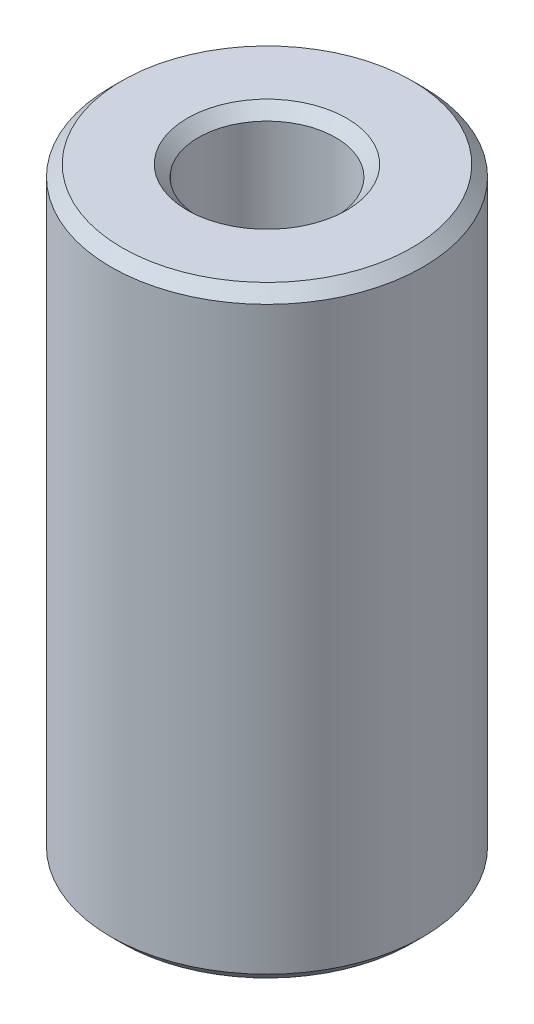
ISO-10303-21;
HEADER;
FILE_DESCRIPTION(('STEP AP214'),'2;1');
FILE_NAME('part.step','',(''),(''),'','','');
FILE_SCHEMA(('AUTOMOTIVE_DESIGN { 1 0 10303 214 1 1 1 1 }'));
ENDSEC;
DATA;
#1=APPLICATION_CONTEXT('core data for automotive mechanical design processes');
#2=APPLICATION_PROTOCOL_DEFINITION('international standard','automotive_design',2000,#1);
#3=PRODUCT_CONTEXT('',#1,'mechanical');
#4=PRODUCT('Part','Part','',(#3));
#5=PRODUCT_RELATED_PRODUCT_CATEGORY('part','',(#4));
#6=PRODUCT_DEFINITION_FORMATION('','',#4);
#7=PRODUCT_DEFINITION_CONTEXT('part definition',#1,'design');
#8=PRODUCT_DEFINITION('design','',#6,#7);
#9=PRODUCT_DEFINITION_SHAPE('','',#8);
#10=(LENGTH_UNIT() NAMED_UNIT(*) SI_UNIT(.MILLI.,.METRE.));
#11=(NAMED_UNIT(*) PLANE_ANGLE_UNIT() SI_UNIT($,.RADIAN.));
#12=(NAMED_UNIT(*) SI_UNIT($,.STERADIAN.) SOLID_ANGLE_UNIT());
#13=UNCERTAINTY_MEASURE_WITH_UNIT(LENGTH_MEASURE(1.E-05),#10,'distance_accuracy_value','');
#14=(GEOMETRIC_REPRESENTATION_CONTEXT(3) GLOBAL_UNCERTAINTY_ASSIGNED_CONTEXT((#13)) GLOBAL_UNIT_ASSIGNED_CONTEXT((#10,
#11,#12)) REPRESENTATION_CONTEXT('',''));
#15=CARTESIAN_POINT('',(0.,0.,0.));
#16=DIRECTION('',(0.,0.,1.));
#17=DIRECTION('',(1.,0.,0.));
#18=AXIS2_PLACEMENT_3D('',#15,#16,#17);
#19=CARTESIAN_POINT('',(0.,28.9714536347229,0.));
#20=DIRECTION('',(0.,-1.,0.));
#21=DIRECTION('',(0.,0.,-1.));
#22=AXIS2_PLACEMENT_3D('',#19,#20,#21);
#23=CYLINDRICAL_SURFACE('',#22,7.5);
#24=CARTESIAN_POINT('',(0.,0.535824261476907,0.));
#25=DIRECTION('',(0.,1.,0.));
#26=DIRECTION('',(0.,0.,1.));
#27=AXIS2_PLACEMENT_3D('',#24,#25,#26);
#28=CIRCLE('',#27,7.5);
#29=CARTESIAN_POINT('',(0.,0.535824261476907,7.5));
#30=VERTEX_POINT('',#29);
#31=EDGE_CURVE('E10',#30,#30,#28,.T.);
#32=ORIENTED_EDGE('',*,*,#31,.T.);
#33=EDGE_LOOP('',(#32));
#34=FACE_BOUND('',#33,.T.);
#35=CARTESIAN_POINT('',(0.,28.435629373246,0.));
#36=DIRECTION('',(0.,1.,0.));
#37=DIRECTION('',(0.,0.,1.));
#38=AXIS2_PLACEMENT_3D('',#35,#36,#37);
#39=CIRCLE('',#38,7.5);
#40=CARTESIAN_POINT('',(0.,28.435629373246,7.5));
#41=VERTEX_POINT('',#40);
#42=EDGE_CURVE('E50',#41,#41,#39,.F.);
#43=ORIENTED_EDGE('',*,*,#42,.T.);
#44=EDGE_LOOP('',(#43));
#45=FACE_BOUND('',#44,.T.);
#46=ADVANCED_FACE('F39',(#34,#45),#23,.T.);
#47=CARTESIAN_POINT('',(0.,28.9714536347229,0.));
#48=DIRECTION('',(0.,1.,0.));
#49=DIRECTION('',(0.,0.,1.));
#50=AXIS2_PLACEMENT_3D('',#47,#48,#49);
#51=PLANE('',#50);
#52=CARTESIAN_POINT('',(0.,28.9714536347229,0.));
#53=DIRECTION('',(0.,1.,0.));
#54=DIRECTION('',(0.,0.,1.));
#55=AXIS2_PLACEMENT_3D('',#52,#53,#54);
#56=CIRCLE('',#55,3.83472451411904);
#57=CARTESIAN_POINT('',(0.,28.9714536347229,3.83472451411904));
#58=VERTEX_POINT('',#57);
#59=EDGE_CURVE('E58',#58,#58,#56,.F.);
#60=ORIENTED_EDGE('',*,*,#59,.T.);
#61=EDGE_LOOP('',(#60));
#62=FACE_BOUND('',#61,.T.);
#63=CARTESIAN_POINT('',(0.,28.9714536347229,0.));
#64=DIRECTION('',(0.,1.,0.));
#65=DIRECTION('',(0.,0.,1.));
#66=AXIS2_PLACEMENT_3D('',#63,#64,#65);
#67=CIRCLE('',#66,6.9641757385231);
#68=CARTESIAN_POINT('',(0.,28.9714536347229,6.9641757385231));
#69=VERTEX_POINT('',#68);
#70=EDGE_CURVE('E61',#69,#69,#67,.T.);
#71=ORIENTED_EDGE('',*,*,#70,.T.);
#72=EDGE_LOOP('',(#71));
#73=FACE_BOUND('',#72,.T.);
#74=ADVANCED_FACE('F88',(#62,#73),#51,.T.);
#75=CARTESIAN_POINT('',(0.,0.,0.));
#76=DIRECTION('',(0.,1.,0.));
#77=DIRECTION('',(0.,0.,1.));
#78=AXIS2_PLACEMENT_3D('',#75,#76,#77);
#79=PLANE('',#78);
#80=CARTESIAN_POINT('',(0.,0.,0.));
#81=DIRECTION('',(0.,1.,0.));
#82=DIRECTION('',(0.,0.,1.));
#83=AXIS2_PLACEMENT_3D('',#80,#81,#82);
#84=CIRCLE('',#83,3.83472451411904);
#85=CARTESIAN_POINT('',(0.,0.,3.83472451411904));
#86=VERTEX_POINT('',#85);
#87=EDGE_CURVE('E51',#86,#86,#84,.T.);
#88=ORIENTED_EDGE('',*,*,#87,.T.);
#89=EDGE_LOOP('',(#88));
#90=FACE_BOUND('',#89,.T.);
#91=CARTESIAN_POINT('',(0.,0.,0.));
#92=DIRECTION('',(0.,1.,0.));
#93=DIRECTION('',(0.,0.,1.));
#94=AXIS2_PLACEMENT_3D('',#91,#92,#93);
#95=CIRCLE('',#94,6.96417573852309);
#96=CARTESIAN_POINT('',(0.,0.,6.96417573852309));
#97=VERTEX_POINT('',#96);
#98=EDGE_CURVE('E54',#97,#97,#95,.F.);
#99=ORIENTED_EDGE('',*,*,#98,.T.);
#100=EDGE_LOOP('',(#99));
#101=FACE_BOUND('',#100,.T.);
#102=ADVANCED_FACE('F83',(#90,#101),#79,.F.);
#103=CARTESIAN_POINT('',(0.,28.9714536347229,0.));
#104=DIRECTION('',(0.,-1.,0.));
#105=DIRECTION('',(0.,0.,-1.));
#106=AXIS2_PLACEMENT_3D('',#103,#104,#105);
#107=CYLINDRICAL_SURFACE('',#106,3.29890025264214);
#108=CARTESIAN_POINT('',(0.,28.435629373246,0.));
#109=DIRECTION('',(0.,1.,0.));
#110=DIRECTION('',(0.,0.,1.));
#111=AXIS2_PLACEMENT_3D('',#108,#109,#110);
#112=CIRCLE('',#111,3.29890025264214);
#113=CARTESIAN_POINT('',(0.,28.435629373246,3.29890025264214));
#114=VERTEX_POINT('',#113);
#115=EDGE_CURVE('E67',#114,#114,#112,.T.);
#116=ORIENTED_EDGE('',*,*,#115,.T.);
#117=EDGE_LOOP('',(#116));
#118=FACE_BOUND('',#117,.T.);
#119=CARTESIAN_POINT('',(0.,0.535824261476907,0.));
#120=DIRECTION('',(0.,1.,0.));
#121=DIRECTION('',(0.,0.,1.));
#122=AXIS2_PLACEMENT_3D('',#119,#120,#121);
#123=CIRCLE('',#122,3.29890025264214);
#124=CARTESIAN_POINT('',(0.,0.535824261476907,3.29890025264214));
#125=VERTEX_POINT('',#124);
#126=EDGE_CURVE('E69',#125,#125,#123,.F.);
#127=ORIENTED_EDGE('',*,*,#126,.T.);
#128=EDGE_LOOP('',(#127));
#129=FACE_BOUND('',#128,.T.);
#130=ADVANCED_FACE('F71',(#118,#129),#107,.F.);
#131=CARTESIAN_POINT('',(0.,28.435629373246,0.));
#132=DIRECTION('',(0.,1.,0.));
#133=DIRECTION('',(0.,0.,1.));
#134=AXIS2_PLACEMENT_3D('',#131,#132,#133);
#135=CONICAL_SURFACE('',#134,3.29890025264214,0.785398163397456);
#136=ORIENTED_EDGE('',*,*,#59,.F.);
#137=EDGE_LOOP('',(#136));
#138=FACE_BOUND('',#137,.T.);
#139=ORIENTED_EDGE('',*,*,#115,.F.);
#140=EDGE_LOOP('',(#139));
#141=FACE_BOUND('',#140,.T.);
#142=ADVANCED_FACE('F77',(#138,#141),#135,.F.);
#143=CARTESIAN_POINT('',(0.,0.,0.));
#144=DIRECTION('',(0.,-1.,0.));
#145=DIRECTION('',(0.,0.,-1.));
#146=AXIS2_PLACEMENT_3D('',#143,#144,#145);
#147=CONICAL_SURFACE('',#146,3.83472451411904,0.785398163397443);
#148=ORIENTED_EDGE('',*,*,#126,.F.);
#149=EDGE_LOOP('',(#148));
#150=FACE_BOUND('',#149,.T.);
#151=ORIENTED_EDGE('',*,*,#87,.F.);
#152=EDGE_LOOP('',(#151));
#153=FACE_BOUND('',#152,.T.);
#154=ADVANCED_FACE('F73',(#150,#153),#147,.F.);
#155=CARTESIAN_POINT('',(0.,0.535824261476907,0.));
#156=DIRECTION('',(0.,1.,0.));
#157=DIRECTION('',(0.,0.,1.));
#158=AXIS2_PLACEMENT_3D('',#155,#156,#157);
#159=CONICAL_SURFACE('',#158,7.5,0.785398163397452);
#160=ORIENTED_EDGE('',*,*,#98,.F.);
#161=EDGE_LOOP('',(#160));
#162=FACE_BOUND('',#161,.T.);
#163=ORIENTED_EDGE('',*,*,#31,.F.);
#164=EDGE_LOOP('',(#163));
#165=FACE_BOUND('',#164,.T.);
#166=ADVANCED_FACE('F76',(#162,#165),#159,.T.);
#167=CARTESIAN_POINT('',(0.,28.9714536347229,0.));
#168=DIRECTION('',(0.,-1.,0.));
#169=DIRECTION('',(0.,0.,-1.));
#170=AXIS2_PLACEMENT_3D('',#167,#168,#169);
#171=CONICAL_SURFACE('',#170,6.9641757385231,0.785398163397445);
#172=ORIENTED_EDGE('',*,*,#42,.F.);
#173=EDGE_LOOP('',(#172));
#174=FACE_BOUND('',#173,.T.);
#175=ORIENTED_EDGE('',*,*,#70,.F.);
#176=EDGE_LOOP('',(#175));
#177=FACE_BOUND('',#176,.T.);
#178=ADVANCED_FACE('F45',(#174,#177),#171,.T.);
#179=CLOSED_SHELL('',(#46,#74,#102,#130,#142,#154,#166,#178));
#180=MANIFOLD_SOLID_BREP('B2',#179);
#181=ADVANCED_BREP_SHAPE_REPRESENTATION('',(#18,#180),#14);
#182=SHAPE_DEFINITION_REPRESENTATION(#9,#181);
ENDSEC;
END-ISO-10303-21;
